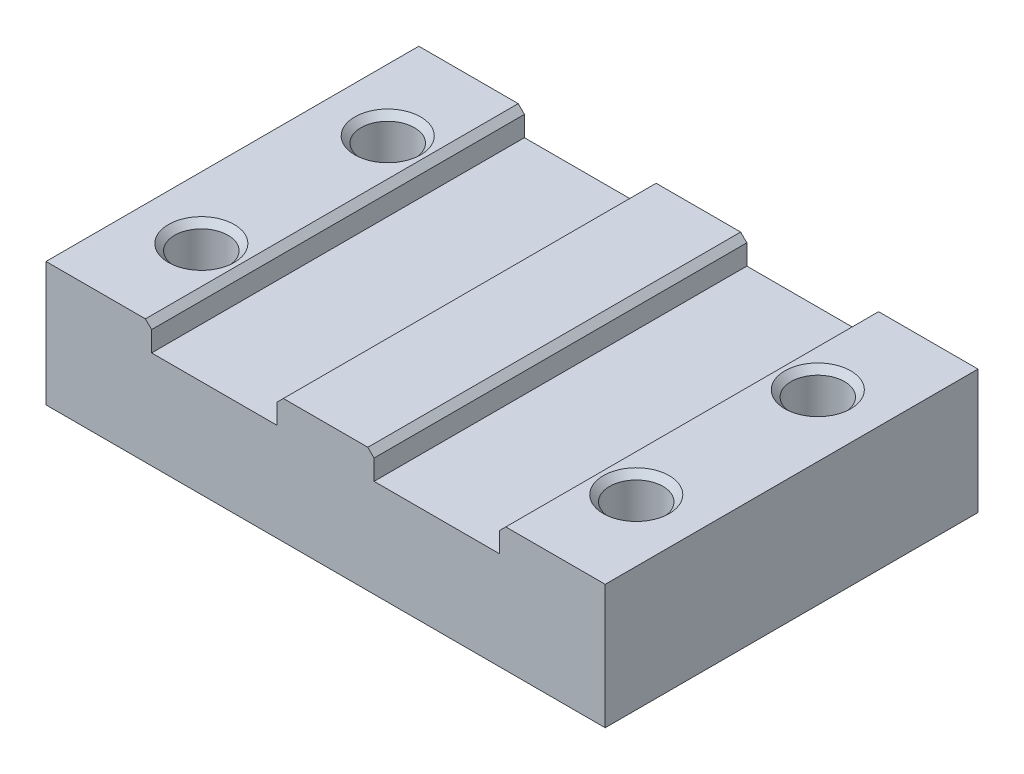
ISO-10303-21;
HEADER;
FILE_DESCRIPTION(('STEP AP214'),'2;1');
FILE_NAME('part.step','',(''),(''),'','','');
FILE_SCHEMA(('AUTOMOTIVE_DESIGN { 1 0 10303 214 1 1 1 1 }'));
ENDSEC;
DATA;
#1=APPLICATION_CONTEXT('core data for automotive mechanical design processes');
#2=APPLICATION_PROTOCOL_DEFINITION('international standard','automotive_design',2000,#1);
#3=PRODUCT_CONTEXT('',#1,'mechanical');
#4=PRODUCT('Part','Part','',(#3));
#5=PRODUCT_RELATED_PRODUCT_CATEGORY('part','',(#4));
#6=PRODUCT_DEFINITION_FORMATION('','',#4);
#7=PRODUCT_DEFINITION_CONTEXT('part definition',#1,'design');
#8=PRODUCT_DEFINITION('design','',#6,#7);
#9=PRODUCT_DEFINITION_SHAPE('','',#8);
#10=(LENGTH_UNIT() NAMED_UNIT(*) SI_UNIT(.MILLI.,.METRE.));
#11=(NAMED_UNIT(*) PLANE_ANGLE_UNIT() SI_UNIT($,.RADIAN.));
#12=(NAMED_UNIT(*) SI_UNIT($,.STERADIAN.) SOLID_ANGLE_UNIT());
#13=UNCERTAINTY_MEASURE_WITH_UNIT(LENGTH_MEASURE(1.E-05),#10,'distance_accuracy_value','');
#14=(GEOMETRIC_REPRESENTATION_CONTEXT(3) GLOBAL_UNCERTAINTY_ASSIGNED_CONTEXT((#13)) GLOBAL_UNIT_ASSIGNED_CONTEXT((#10,
#11,#12)) REPRESENTATION_CONTEXT('',''));
#15=CARTESIAN_POINT('',(0.,0.,0.));
#16=DIRECTION('',(0.,0.,1.));
#17=DIRECTION('',(1.,0.,0.));
#18=AXIS2_PLACEMENT_3D('',#15,#16,#17);
#19=CARTESIAN_POINT('',(0.,20.,0.));
#20=DIRECTION('',(0.,1.,0.));
#21=DIRECTION('',(0.,0.,1.));
#22=AXIS2_PLACEMENT_3D('',#19,#20,#21);
#23=PLANE('',#22);
#24=CARTESIAN_POINT('',(35.,20.,-14.2172732356869));
#25=DIRECTION('',(0.,1.,0.));
#26=DIRECTION('',(0.,0.,1.));
#27=AXIS2_PLACEMENT_3D('',#24,#25,#26);
#28=CIRCLE('',#27,5.3);
#29=CARTESIAN_POINT('',(35.,20.,-8.91727323568689));
#30=VERTEX_POINT('',#29);
#31=EDGE_CURVE('E277',#30,#30,#28,.F.);
#32=ORIENTED_EDGE('',*,*,#31,.T.);
#33=EDGE_LOOP('',(#32));
#34=FACE_BOUND('',#33,.T.);
#35=CARTESIAN_POINT('',(35.,20.,15.));
#36=DIRECTION('',(0.,1.,0.));
#37=DIRECTION('',(0.,0.,1.));
#38=AXIS2_PLACEMENT_3D('',#35,#36,#37);
#39=CIRCLE('',#38,5.3);
#40=CARTESIAN_POINT('',(35.,20.,20.3));
#41=VERTEX_POINT('',#40);
#42=EDGE_CURVE('E274',#41,#41,#39,.F.);
#43=ORIENTED_EDGE('',*,*,#42,.T.);
#44=EDGE_LOOP('',(#43));
#45=FACE_BOUND('',#44,.T.);
#46=DIRECTION('',(-1.,0.,0.));
#47=VECTOR('',#46,1.);
#48=CARTESIAN_POINT('',(45.,20.,-30.));
#49=LINE('',#48,#47);
#50=CARTESIAN_POINT('',(45.,20.,-30.));
#51=VERTEX_POINT('',#50);
#52=CARTESIAN_POINT('',(29.,20.,-30.));
#53=VERTEX_POINT('',#52);
#54=EDGE_CURVE('E218',#51,#53,#49,.T.);
#55=ORIENTED_EDGE('',*,*,#54,.T.);
#56=DIRECTION('',(0.,0.,1.));
#57=VECTOR('',#56,1.);
#58=CARTESIAN_POINT('',(29.,20.,30.));
#59=LINE('',#58,#57);
#60=CARTESIAN_POINT('',(29.,20.,30.));
#61=VERTEX_POINT('',#60);
#62=EDGE_CURVE('E272',#53,#61,#59,.T.);
#63=ORIENTED_EDGE('',*,*,#62,.T.);
#64=DIRECTION('',(1.,0.,0.));
#65=VECTOR('',#64,1.);
#66=CARTESIAN_POINT('',(45.,20.,30.));
#67=LINE('',#66,#65);
#68=CARTESIAN_POINT('',(45.,20.,30.));
#69=VERTEX_POINT('',#68);
#70=EDGE_CURVE('E209',#61,#69,#67,.T.);
#71=ORIENTED_EDGE('',*,*,#70,.T.);
#72=DIRECTION('',(0.,0.,-1.));
#73=VECTOR('',#72,1.);
#74=CARTESIAN_POINT('',(45.,20.,30.));
#75=LINE('',#74,#73);
#76=EDGE_CURVE('E214',#69,#51,#75,.T.);
#77=ORIENTED_EDGE('',*,*,#76,.T.);
#78=EDGE_LOOP('',(#55,#63,#71,#77));
#79=FACE_BOUND('',#78,.T.);
#80=ADVANCED_FACE('F35',(#34,#45,#79),#23,.T.);
#81=CARTESIAN_POINT('',(-35.,20.,15.));
#82=DIRECTION('',(0.,1.,0.));
#83=DIRECTION('',(0.,0.,1.));
#84=AXIS2_PLACEMENT_3D('',#81,#82,#83);
#85=CIRCLE('',#84,5.3);
#86=CARTESIAN_POINT('',(-35.,20.,20.3));
#87=VERTEX_POINT('',#86);
#88=EDGE_CURVE('E289',#87,#87,#85,.F.);
#89=ORIENTED_EDGE('',*,*,#88,.T.);
#90=EDGE_LOOP('',(#89));
#91=FACE_BOUND('',#90,.T.);
#92=CARTESIAN_POINT('',(-35.,20.,-15.));
#93=DIRECTION('',(0.,1.,0.));
#94=DIRECTION('',(0.,0.,1.));
#95=AXIS2_PLACEMENT_3D('',#92,#93,#94);
#96=CIRCLE('',#95,5.3);
#97=CARTESIAN_POINT('',(-35.,20.,-9.7));
#98=VERTEX_POINT('',#97);
#99=EDGE_CURVE('E286',#98,#98,#96,.F.);
#100=ORIENTED_EDGE('',*,*,#99,.T.);
#101=EDGE_LOOP('',(#100));
#102=FACE_BOUND('',#101,.T.);
#103=CARTESIAN_POINT('',(-45.,20.,30.));
#104=VERTEX_POINT('',#103);
#105=CARTESIAN_POINT('',(-29.,20.,30.));
#106=VERTEX_POINT('',#105);
#107=EDGE_CURVE('E211',#104,#106,#67,.T.);
#108=ORIENTED_EDGE('',*,*,#107,.T.);
#109=DIRECTION('',(0.,0.,-1.));
#110=VECTOR('',#109,1.);
#111=CARTESIAN_POINT('',(-29.,20.,-30.));
#112=LINE('',#111,#110);
#113=CARTESIAN_POINT('',(-29.,20.,-30.));
#114=VERTEX_POINT('',#113);
#115=EDGE_CURVE('E267',#106,#114,#112,.T.);
#116=ORIENTED_EDGE('',*,*,#115,.T.);
#117=CARTESIAN_POINT('',(-45.,20.,-30.));
#118=VERTEX_POINT('',#117);
#119=EDGE_CURVE('E217',#114,#118,#49,.T.);
#120=ORIENTED_EDGE('',*,*,#119,.T.);
#121=DIRECTION('',(0.,0.,1.));
#122=VECTOR('',#121,1.);
#123=CARTESIAN_POINT('',(-45.,20.,30.));
#124=LINE('',#123,#122);
#125=EDGE_CURVE('E206',#118,#104,#124,.T.);
#126=ORIENTED_EDGE('',*,*,#125,.T.);
#127=EDGE_LOOP('',(#108,#116,#120,#126));
#128=FACE_BOUND('',#127,.T.);
#129=ADVANCED_FACE('F303',(#91,#102,#128),#23,.T.);
#130=CARTESIAN_POINT('',(-45.,20.,30.));
#131=DIRECTION('',(1.,0.,0.));
#132=DIRECTION('',(0.,0.,-1.));
#133=AXIS2_PLACEMENT_3D('',#130,#131,#132);
#134=PLANE('',#133);
#135=DIRECTION('',(0.,0.,1.));
#136=VECTOR('',#135,1.);
#137=CARTESIAN_POINT('',(-45.,0.,30.));
#138=LINE('',#137,#136);
#139=CARTESIAN_POINT('',(-45.,0.,-30.));
#140=VERTEX_POINT('',#139);
#141=CARTESIAN_POINT('',(-45.,0.,30.));
#142=VERTEX_POINT('',#141);
#143=EDGE_CURVE('E201',#140,#142,#138,.T.);
#144=ORIENTED_EDGE('',*,*,#143,.T.);
#145=DIRECTION('',(0.,-1.,0.));
#146=VECTOR('',#145,1.);
#147=CARTESIAN_POINT('',(-45.,20.,30.));
#148=LINE('',#147,#146);
#149=EDGE_CURVE('E238',#104,#142,#148,.T.);
#150=ORIENTED_EDGE('',*,*,#149,.F.);
#151=ORIENTED_EDGE('',*,*,#125,.F.);
#152=DIRECTION('',(0.,-1.,0.));
#153=VECTOR('',#152,1.);
#154=CARTESIAN_POINT('',(-45.,20.,-30.));
#155=LINE('',#154,#153);
#156=EDGE_CURVE('E221',#118,#140,#155,.T.);
#157=ORIENTED_EDGE('',*,*,#156,.T.);
#158=EDGE_LOOP('',(#144,#150,#151,#157));
#159=FACE_BOUND('',#158,.T.);
#160=ADVANCED_FACE('F306',(#159),#134,.F.);
#161=CARTESIAN_POINT('',(45.,20.,30.));
#162=DIRECTION('',(0.,0.,-1.));
#163=DIRECTION('',(-1.,0.,0.));
#164=AXIS2_PLACEMENT_3D('',#161,#162,#163);
#165=PLANE('',#164);
#166=CARTESIAN_POINT('',(-6.79999999999997,20.,30.));
#167=VERTEX_POINT('',#166);
#168=CARTESIAN_POINT('',(6.80000000000004,20.,30.));
#169=VERTEX_POINT('',#168);
#170=EDGE_CURVE('E215',#167,#169,#67,.T.);
#171=ORIENTED_EDGE('',*,*,#170,.F.);
#172=DIRECTION('',(-0.707106781186548,-0.707106781186548,0.));
#173=VECTOR('',#172,1.);
#174=CARTESIAN_POINT('',(-6.79999999999998,20.,30.));
#175=LINE('',#174,#173);
#176=CARTESIAN_POINT('',(-7.79999999999999,19.,30.));
#177=VERTEX_POINT('',#176);
#178=EDGE_CURVE('E252',#167,#177,#175,.T.);
#179=ORIENTED_EDGE('',*,*,#178,.T.);
#180=DIRECTION('',(0.,1.,0.));
#181=VECTOR('',#180,1.);
#182=CARTESIAN_POINT('',(-7.8,20.,30.));
#183=LINE('',#182,#181);
#184=CARTESIAN_POINT('',(-7.79999999999999,15.75,30.));
#185=VERTEX_POINT('',#184);
#186=EDGE_CURVE('E190',#185,#177,#183,.T.);
#187=ORIENTED_EDGE('',*,*,#186,.F.);
#188=DIRECTION('',(1.,0.,0.));
#189=VECTOR('',#188,1.);
#190=CARTESIAN_POINT('',(-7.79999999999999,15.75,30.));
#191=LINE('',#190,#189);
#192=CARTESIAN_POINT('',(-28.,15.75,30.));
#193=VERTEX_POINT('',#192);
#194=EDGE_CURVE('E156',#193,#185,#191,.T.);
#195=ORIENTED_EDGE('',*,*,#194,.F.);
#196=DIRECTION('',(0.,-1.,0.));
#197=VECTOR('',#196,1.);
#198=CARTESIAN_POINT('',(-28.,24.25,30.));
#199=LINE('',#198,#197);
#200=CARTESIAN_POINT('',(-28.,19.,30.));
#201=VERTEX_POINT('',#200);
#202=EDGE_CURVE('E173',#201,#193,#199,.T.);
#203=ORIENTED_EDGE('',*,*,#202,.F.);
#204=DIRECTION('',(-0.707106781186543,0.707106781186552,0.));
#205=VECTOR('',#204,1.);
#206=CARTESIAN_POINT('',(-28.,19.,30.));
#207=LINE('',#206,#205);
#208=EDGE_CURVE('E248',#201,#106,#207,.T.);
#209=ORIENTED_EDGE('',*,*,#208,.T.);
#210=ORIENTED_EDGE('',*,*,#107,.F.);
#211=ORIENTED_EDGE('',*,*,#149,.T.);
#212=DIRECTION('',(1.,0.,0.));
#213=VECTOR('',#212,1.);
#214=CARTESIAN_POINT('',(45.,0.,30.));
#215=LINE('',#214,#213);
#216=CARTESIAN_POINT('',(45.,0.,30.));
#217=VERTEX_POINT('',#216);
#218=EDGE_CURVE('E225',#142,#217,#215,.T.);
#219=ORIENTED_EDGE('',*,*,#218,.T.);
#220=DIRECTION('',(0.,-1.,0.));
#221=VECTOR('',#220,1.);
#222=CARTESIAN_POINT('',(45.,20.,30.));
#223=LINE('',#222,#221);
#224=EDGE_CURVE('E235',#69,#217,#223,.T.);
#225=ORIENTED_EDGE('',*,*,#224,.F.);
#226=ORIENTED_EDGE('',*,*,#70,.F.);
#227=DIRECTION('',(-0.707106781186544,-0.707106781186551,0.));
#228=VECTOR('',#227,1.);
#229=CARTESIAN_POINT('',(28.,19.,30.));
#230=LINE('',#229,#228);
#231=CARTESIAN_POINT('',(28.,19.,30.));
#232=VERTEX_POINT('',#231);
#233=EDGE_CURVE('E246',#61,#232,#230,.T.);
#234=ORIENTED_EDGE('',*,*,#233,.T.);
#235=DIRECTION('',(0.,1.,0.));
#236=VECTOR('',#235,1.);
#237=CARTESIAN_POINT('',(28.,24.25,30.));
#238=LINE('',#237,#236);
#239=CARTESIAN_POINT('',(28.,15.75,30.));
#240=VERTEX_POINT('',#239);
#241=EDGE_CURVE('E175',#240,#232,#238,.T.);
#242=ORIENTED_EDGE('',*,*,#241,.F.);
#243=DIRECTION('',(1.,0.,0.));
#244=VECTOR('',#243,1.);
#245=CARTESIAN_POINT('',(28.,15.75,30.));
#246=LINE('',#245,#244);
#247=CARTESIAN_POINT('',(7.80000000000001,15.75,30.));
#248=VERTEX_POINT('',#247);
#249=EDGE_CURVE('E194',#248,#240,#246,.T.);
#250=ORIENTED_EDGE('',*,*,#249,.F.);
#251=DIRECTION('',(0.,-1.,0.));
#252=VECTOR('',#251,1.);
#253=CARTESIAN_POINT('',(7.80000000000001,15.75,30.));
#254=LINE('',#253,#252);
#255=CARTESIAN_POINT('',(7.80000000000001,19.,30.));
#256=VERTEX_POINT('',#255);
#257=EDGE_CURVE('E192',#256,#248,#254,.T.);
#258=ORIENTED_EDGE('',*,*,#257,.F.);
#259=DIRECTION('',(-0.707106781186543,0.707106781186552,0.));
#260=VECTOR('',#259,1.);
#261=CARTESIAN_POINT('',(7.80000000000001,19.,30.));
#262=LINE('',#261,#260);
#263=EDGE_CURVE('E250',#256,#169,#262,.T.);
#264=ORIENTED_EDGE('',*,*,#263,.T.);
#265=EDGE_LOOP('',(#171,#179,#187,#195,#203,#209,#210,#211,#219,#225,#226,#234,#242,#250,#258,#264));
#266=FACE_BOUND('',#265,.T.);
#267=ADVANCED_FACE('F322',(#266),#165,.F.);
#268=CARTESIAN_POINT('',(45.,20.,30.));
#269=DIRECTION('',(-1.,0.,0.));
#270=DIRECTION('',(0.,0.,1.));
#271=AXIS2_PLACEMENT_3D('',#268,#269,#270);
#272=PLANE('',#271);
#273=DIRECTION('',(0.,0.,-1.));
#274=VECTOR('',#273,1.);
#275=CARTESIAN_POINT('',(45.,0.,30.));
#276=LINE('',#275,#274);
#277=CARTESIAN_POINT('',(45.,0.,-30.));
#278=VERTEX_POINT('',#277);
#279=EDGE_CURVE('E227',#217,#278,#276,.T.);
#280=ORIENTED_EDGE('',*,*,#279,.T.);
#281=DIRECTION('',(0.,-1.,0.));
#282=VECTOR('',#281,1.);
#283=CARTESIAN_POINT('',(45.,20.,-30.));
#284=LINE('',#283,#282);
#285=EDGE_CURVE('E232',#51,#278,#284,.T.);
#286=ORIENTED_EDGE('',*,*,#285,.F.);
#287=ORIENTED_EDGE('',*,*,#76,.F.);
#288=ORIENTED_EDGE('',*,*,#224,.T.);
#289=EDGE_LOOP('',(#280,#286,#287,#288));
#290=FACE_BOUND('',#289,.T.);
#291=ADVANCED_FACE('F340',(#290),#272,.F.);
#292=CARTESIAN_POINT('',(45.,20.,-30.));
#293=DIRECTION('',(0.,0.,1.));
#294=DIRECTION('',(1.,0.,0.));
#295=AXIS2_PLACEMENT_3D('',#292,#293,#294);
#296=PLANE('',#295);
#297=DIRECTION('',(0.,1.,0.));
#298=VECTOR('',#297,1.);
#299=CARTESIAN_POINT('',(-7.8,20.,-30.));
#300=LINE('',#299,#298);
#301=CARTESIAN_POINT('',(-7.79999999999999,15.75,-30.));
#302=VERTEX_POINT('',#301);
#303=CARTESIAN_POINT('',(-7.79999999999999,19.,-30.));
#304=VERTEX_POINT('',#303);
#305=EDGE_CURVE('E164',#302,#304,#300,.T.);
#306=ORIENTED_EDGE('',*,*,#305,.T.);
#307=DIRECTION('',(0.707106781186548,0.707106781186548,0.));
#308=VECTOR('',#307,1.);
#309=CARTESIAN_POINT('',(-6.79999999999998,20.,-30.));
#310=LINE('',#309,#308);
#311=CARTESIAN_POINT('',(-6.79999999999997,20.,-30.));
#312=VERTEX_POINT('',#311);
#313=EDGE_CURVE('E259',#304,#312,#310,.T.);
#314=ORIENTED_EDGE('',*,*,#313,.T.);
#315=CARTESIAN_POINT('',(6.80000000000004,20.,-30.));
#316=VERTEX_POINT('',#315);
#317=EDGE_CURVE('E222',#316,#312,#49,.T.);
#318=ORIENTED_EDGE('',*,*,#317,.F.);
#319=DIRECTION('',(0.707106781186543,-0.707106781186552,0.));
#320=VECTOR('',#319,1.);
#321=CARTESIAN_POINT('',(7.80000000000001,19.,-30.));
#322=LINE('',#321,#320);
#323=CARTESIAN_POINT('',(7.80000000000001,19.,-30.));
#324=VERTEX_POINT('',#323);
#325=EDGE_CURVE('E50',#316,#324,#322,.T.);
#326=ORIENTED_EDGE('',*,*,#325,.T.);
#327=DIRECTION('',(0.,-1.,0.));
#328=VECTOR('',#327,1.);
#329=CARTESIAN_POINT('',(7.80000000000001,15.75,-30.));
#330=LINE('',#329,#328);
#331=CARTESIAN_POINT('',(7.80000000000001,15.75,-30.));
#332=VERTEX_POINT('',#331);
#333=EDGE_CURVE('E169',#324,#332,#330,.T.);
#334=ORIENTED_EDGE('',*,*,#333,.T.);
#335=DIRECTION('',(1.,0.,0.));
#336=VECTOR('',#335,1.);
#337=CARTESIAN_POINT('',(28.,15.75,-30.));
#338=LINE('',#337,#336);
#339=CARTESIAN_POINT('',(28.,15.75,-30.));
#340=VERTEX_POINT('',#339);
#341=EDGE_CURVE('E182',#332,#340,#338,.T.);
#342=ORIENTED_EDGE('',*,*,#341,.T.);
#343=DIRECTION('',(0.,1.,0.));
#344=VECTOR('',#343,1.);
#345=CARTESIAN_POINT('',(28.,24.25,-30.));
#346=LINE('',#345,#344);
#347=CARTESIAN_POINT('',(28.,19.,-30.));
#348=VERTEX_POINT('',#347);
#349=EDGE_CURVE('E185',#340,#348,#346,.T.);
#350=ORIENTED_EDGE('',*,*,#349,.T.);
#351=DIRECTION('',(0.707106781186544,0.707106781186551,0.));
#352=VECTOR('',#351,1.);
#353=CARTESIAN_POINT('',(28.,19.,-30.));
#354=LINE('',#353,#352);
#355=EDGE_CURVE('E255',#348,#53,#354,.T.);
#356=ORIENTED_EDGE('',*,*,#355,.T.);
#357=ORIENTED_EDGE('',*,*,#54,.F.);
#358=ORIENTED_EDGE('',*,*,#285,.T.);
#359=DIRECTION('',(-1.,0.,0.));
#360=VECTOR('',#359,1.);
#361=CARTESIAN_POINT('',(45.,0.,-30.));
#362=LINE('',#361,#360);
#363=EDGE_CURVE('E210',#278,#140,#362,.T.);
#364=ORIENTED_EDGE('',*,*,#363,.T.);
#365=ORIENTED_EDGE('',*,*,#156,.F.);
#366=ORIENTED_EDGE('',*,*,#119,.F.);
#367=DIRECTION('',(0.707106781186543,-0.707106781186552,0.));
#368=VECTOR('',#367,1.);
#369=CARTESIAN_POINT('',(-28.,19.,-30.));
#370=LINE('',#369,#368);
#371=CARTESIAN_POINT('',(-28.,19.,-30.));
#372=VERTEX_POINT('',#371);
#373=EDGE_CURVE('E57',#114,#372,#370,.T.);
#374=ORIENTED_EDGE('',*,*,#373,.T.);
#375=DIRECTION('',(0.,-1.,0.));
#376=VECTOR('',#375,1.);
#377=CARTESIAN_POINT('',(-28.,24.25,-30.));
#378=LINE('',#377,#376);
#379=CARTESIAN_POINT('',(-28.,15.75,-30.));
#380=VERTEX_POINT('',#379);
#381=EDGE_CURVE('E161',#372,#380,#378,.T.);
#382=ORIENTED_EDGE('',*,*,#381,.T.);
#383=DIRECTION('',(1.,0.,0.));
#384=VECTOR('',#383,1.);
#385=CARTESIAN_POINT('',(-7.79999999999999,15.75,-30.));
#386=LINE('',#385,#384);
#387=EDGE_CURVE('E154',#380,#302,#386,.T.);
#388=ORIENTED_EDGE('',*,*,#387,.T.);
#389=EDGE_LOOP('',(#306,#314,#318,#326,#334,#342,#350,#356,#357,#358,#364,#365,#366,#374,#382,#388));
#390=FACE_BOUND('',#389,.T.);
#391=ADVANCED_FACE('F171',(#390),#296,.F.);
#392=ORIENTED_EDGE('',*,*,#317,.T.);
#393=DIRECTION('',(0.,0.,1.));
#394=VECTOR('',#393,1.);
#395=CARTESIAN_POINT('',(-6.79999999999998,20.,30.));
#396=LINE('',#395,#394);
#397=EDGE_CURVE('E243',#312,#167,#396,.T.);
#398=ORIENTED_EDGE('',*,*,#397,.T.);
#399=ORIENTED_EDGE('',*,*,#170,.T.);
#400=DIRECTION('',(0.,0.,-1.));
#401=VECTOR('',#400,1.);
#402=CARTESIAN_POINT('',(6.80000000000002,20.,-30.));
#403=LINE('',#402,#401);
#404=EDGE_CURVE('E241',#169,#316,#403,.T.);
#405=ORIENTED_EDGE('',*,*,#404,.T.);
#406=EDGE_LOOP('',(#392,#398,#399,#405));
#407=FACE_BOUND('',#406,.T.);
#408=ADVANCED_FACE('F308',(#407),#23,.T.);
#409=CARTESIAN_POINT('',(0.,0.,0.));
#410=DIRECTION('',(0.,1.,0.));
#411=DIRECTION('',(0.,0.,1.));
#412=AXIS2_PLACEMENT_3D('',#409,#410,#411);
#413=PLANE('',#412);
#414=CARTESIAN_POINT('',(-35.,0.,-15.));
#415=DIRECTION('',(0.,-1.,0.));
#416=DIRECTION('',(0.,0.,-1.));
#417=AXIS2_PLACEMENT_3D('',#414,#415,#416);
#418=CIRCLE('',#417,4.3);
#419=CARTESIAN_POINT('',(-35.,0.,-19.3));
#420=VERTEX_POINT('',#419);
#421=EDGE_CURVE('E397',#420,#420,#418,.T.);
#422=ORIENTED_EDGE('',*,*,#421,.F.);
#423=EDGE_LOOP('',(#422));
#424=FACE_BOUND('',#423,.T.);
#425=CARTESIAN_POINT('',(35.,0.,-14.2172732356869));
#426=DIRECTION('',(0.,-1.,0.));
#427=DIRECTION('',(0.,0.,-1.));
#428=AXIS2_PLACEMENT_3D('',#425,#426,#427);
#429=CIRCLE('',#428,4.3);
#430=CARTESIAN_POINT('',(35.,0.,-18.5172732356869));
#431=VERTEX_POINT('',#430);
#432=EDGE_CURVE('E398',#431,#431,#429,.T.);
#433=ORIENTED_EDGE('',*,*,#432,.F.);
#434=EDGE_LOOP('',(#433));
#435=FACE_BOUND('',#434,.T.);
#436=CARTESIAN_POINT('',(35.,0.,15.));
#437=DIRECTION('',(0.,-1.,0.));
#438=DIRECTION('',(0.,0.,-1.));
#439=AXIS2_PLACEMENT_3D('',#436,#437,#438);
#440=CIRCLE('',#439,4.3);
#441=CARTESIAN_POINT('',(35.,0.,10.7));
#442=VERTEX_POINT('',#441);
#443=EDGE_CURVE('E402',#442,#442,#440,.T.);
#444=ORIENTED_EDGE('',*,*,#443,.F.);
#445=EDGE_LOOP('',(#444));
#446=FACE_BOUND('',#445,.T.);
#447=CARTESIAN_POINT('',(-35.,0.,15.));
#448=DIRECTION('',(0.,-1.,0.));
#449=DIRECTION('',(0.,0.,-1.));
#450=AXIS2_PLACEMENT_3D('',#447,#448,#449);
#451=CIRCLE('',#450,4.3);
#452=CARTESIAN_POINT('',(-35.,0.,10.7));
#453=VERTEX_POINT('',#452);
#454=EDGE_CURVE('E178',#453,#453,#451,.T.);
#455=ORIENTED_EDGE('',*,*,#454,.F.);
#456=EDGE_LOOP('',(#455));
#457=FACE_BOUND('',#456,.T.);
#458=ORIENTED_EDGE('',*,*,#143,.F.);
#459=ORIENTED_EDGE('',*,*,#363,.F.);
#460=ORIENTED_EDGE('',*,*,#279,.F.);
#461=ORIENTED_EDGE('',*,*,#218,.F.);
#462=EDGE_LOOP('',(#458,#459,#460,#461));
#463=FACE_BOUND('',#462,.T.);
#464=ADVANCED_FACE('F342',(#424,#435,#446,#457,#463),#413,.F.);
#465=CARTESIAN_POINT('',(-7.8,20.,-30.));
#466=DIRECTION('',(1.,0.,0.));
#467=DIRECTION('',(0.,1.,0.));
#468=AXIS2_PLACEMENT_3D('',#465,#466,#467);
#469=PLANE('',#468);
#470=ORIENTED_EDGE('',*,*,#186,.T.);
#471=DIRECTION('',(0.,0.,-1.));
#472=VECTOR('',#471,1.);
#473=CARTESIAN_POINT('',(-7.79999999999999,19.,-30.));
#474=LINE('',#473,#472);
#475=EDGE_CURVE('E167',#177,#304,#474,.T.);
#476=ORIENTED_EDGE('',*,*,#475,.T.);
#477=ORIENTED_EDGE('',*,*,#305,.F.);
#478=DIRECTION('',(0.,0.,1.));
#479=VECTOR('',#478,1.);
#480=CARTESIAN_POINT('',(-7.79999999999999,15.75,-30.));
#481=LINE('',#480,#479);
#482=EDGE_CURVE('E149',#302,#185,#481,.T.);
#483=ORIENTED_EDGE('',*,*,#482,.T.);
#484=EDGE_LOOP('',(#470,#476,#477,#483));
#485=FACE_BOUND('',#484,.T.);
#486=ADVANCED_FACE('F165',(#485),#469,.F.);
#487=CARTESIAN_POINT('',(-28.,24.25,-30.));
#488=DIRECTION('',(-1.,0.,0.));
#489=DIRECTION('',(0.,-1.,0.));
#490=AXIS2_PLACEMENT_3D('',#487,#488,#489);
#491=PLANE('',#490);
#492=ORIENTED_EDGE('',*,*,#381,.F.);
#493=DIRECTION('',(0.,0.,1.));
#494=VECTOR('',#493,1.);
#495=CARTESIAN_POINT('',(-28.,19.,30.));
#496=LINE('',#495,#494);
#497=EDGE_CURVE('E264',#372,#201,#496,.T.);
#498=ORIENTED_EDGE('',*,*,#497,.T.);
#499=ORIENTED_EDGE('',*,*,#202,.T.);
#500=DIRECTION('',(0.,0.,1.));
#501=VECTOR('',#500,1.);
#502=CARTESIAN_POINT('',(-28.,15.75,-30.));
#503=LINE('',#502,#501);
#504=EDGE_CURVE('E199',#380,#193,#503,.T.);
#505=ORIENTED_EDGE('',*,*,#504,.F.);
#506=EDGE_LOOP('',(#492,#498,#499,#505));
#507=FACE_BOUND('',#506,.T.);
#508=ADVANCED_FACE('F320',(#507),#491,.F.);
#509=CARTESIAN_POINT('',(-7.79999999999999,15.75,-30.));
#510=DIRECTION('',(0.,-1.,0.));
#511=DIRECTION('',(1.,0.,0.));
#512=AXIS2_PLACEMENT_3D('',#509,#510,#511);
#513=PLANE('',#512);
#514=ORIENTED_EDGE('',*,*,#194,.T.);
#515=ORIENTED_EDGE('',*,*,#482,.F.);
#516=ORIENTED_EDGE('',*,*,#387,.F.);
#517=ORIENTED_EDGE('',*,*,#504,.T.);
#518=EDGE_LOOP('',(#514,#515,#516,#517));
#519=FACE_BOUND('',#518,.T.);
#520=ADVANCED_FACE('F151',(#519),#513,.F.);
#521=CARTESIAN_POINT('',(28.,24.25,-30.));
#522=DIRECTION('',(1.,0.,0.));
#523=DIRECTION('',(0.,1.,0.));
#524=AXIS2_PLACEMENT_3D('',#521,#522,#523);
#525=PLANE('',#524);
#526=ORIENTED_EDGE('',*,*,#241,.T.);
#527=DIRECTION('',(0.,0.,-1.));
#528=VECTOR('',#527,1.);
#529=CARTESIAN_POINT('',(28.,19.,-30.));
#530=LINE('',#529,#528);
#531=EDGE_CURVE('E269',#232,#348,#530,.T.);
#532=ORIENTED_EDGE('',*,*,#531,.T.);
#533=ORIENTED_EDGE('',*,*,#349,.F.);
#534=DIRECTION('',(0.,0.,1.));
#535=VECTOR('',#534,1.);
#536=CARTESIAN_POINT('',(28.,15.75,-30.));
#537=LINE('',#536,#535);
#538=EDGE_CURVE('E202',#340,#240,#537,.T.);
#539=ORIENTED_EDGE('',*,*,#538,.T.);
#540=EDGE_LOOP('',(#526,#532,#533,#539));
#541=FACE_BOUND('',#540,.T.);
#542=ADVANCED_FACE('F361',(#541),#525,.F.);
#543=CARTESIAN_POINT('',(28.,15.75,-30.));
#544=DIRECTION('',(0.,-1.,0.));
#545=DIRECTION('',(0.,0.,-1.));
#546=AXIS2_PLACEMENT_3D('',#543,#544,#545);
#547=PLANE('',#546);
#548=ORIENTED_EDGE('',*,*,#249,.T.);
#549=ORIENTED_EDGE('',*,*,#538,.F.);
#550=ORIENTED_EDGE('',*,*,#341,.F.);
#551=DIRECTION('',(0.,0.,1.));
#552=VECTOR('',#551,1.);
#553=CARTESIAN_POINT('',(7.80000000000001,15.75,-30.));
#554=LINE('',#553,#552);
#555=EDGE_CURVE('E160',#332,#248,#554,.T.);
#556=ORIENTED_EDGE('',*,*,#555,.T.);
#557=EDGE_LOOP('',(#548,#549,#550,#556));
#558=FACE_BOUND('',#557,.T.);
#559=ADVANCED_FACE('F366',(#558),#547,.F.);
#560=CARTESIAN_POINT('',(7.80000000000001,15.75,-30.));
#561=DIRECTION('',(-1.,0.,0.));
#562=DIRECTION('',(0.,-1.,0.));
#563=AXIS2_PLACEMENT_3D('',#560,#561,#562);
#564=PLANE('',#563);
#565=ORIENTED_EDGE('',*,*,#333,.F.);
#566=DIRECTION('',(0.,0.,1.));
#567=VECTOR('',#566,1.);
#568=CARTESIAN_POINT('',(7.80000000000001,19.,30.));
#569=LINE('',#568,#567);
#570=EDGE_CURVE('E261',#324,#256,#569,.T.);
#571=ORIENTED_EDGE('',*,*,#570,.T.);
#572=ORIENTED_EDGE('',*,*,#257,.T.);
#573=ORIENTED_EDGE('',*,*,#555,.F.);
#574=EDGE_LOOP('',(#565,#571,#572,#573));
#575=FACE_BOUND('',#574,.T.);
#576=ADVANCED_FACE('F363',(#575),#564,.F.);
#577=CARTESIAN_POINT('',(-35.,20.,15.));
#578=DIRECTION('',(0.,-1.,0.));
#579=DIRECTION('',(0.,0.,-1.));
#580=AXIS2_PLACEMENT_3D('',#577,#578,#579);
#581=CYLINDRICAL_SURFACE('',#580,4.3);
#582=CARTESIAN_POINT('',(-35.,19.,15.));
#583=DIRECTION('',(0.,1.,0.));
#584=DIRECTION('',(0.,0.,1.));
#585=AXIS2_PLACEMENT_3D('',#582,#583,#584);
#586=CIRCLE('',#585,4.3);
#587=CARTESIAN_POINT('',(-35.,19.,19.3));
#588=VERTEX_POINT('',#587);
#589=EDGE_CURVE('E43',#588,#588,#586,.T.);
#590=ORIENTED_EDGE('',*,*,#589,.T.);
#591=EDGE_LOOP('',(#590));
#592=FACE_BOUND('',#591,.T.);
#593=ORIENTED_EDGE('',*,*,#454,.T.);
#594=EDGE_LOOP('',(#593));
#595=FACE_BOUND('',#594,.T.);
#596=ADVANCED_FACE('F294',(#592,#595),#581,.F.);
#597=CARTESIAN_POINT('',(35.,20.,15.));
#598=DIRECTION('',(0.,-1.,0.));
#599=DIRECTION('',(0.,0.,-1.));
#600=AXIS2_PLACEMENT_3D('',#597,#598,#599);
#601=CYLINDRICAL_SURFACE('',#600,4.3);
#602=CARTESIAN_POINT('',(35.,19.,15.));
#603=DIRECTION('',(0.,1.,0.));
#604=DIRECTION('',(0.,0.,1.));
#605=AXIS2_PLACEMENT_3D('',#602,#603,#604);
#606=CIRCLE('',#605,4.3);
#607=CARTESIAN_POINT('',(35.,19.,19.3));
#608=VERTEX_POINT('',#607);
#609=EDGE_CURVE('E283',#608,#608,#606,.T.);
#610=ORIENTED_EDGE('',*,*,#609,.T.);
#611=EDGE_LOOP('',(#610));
#612=FACE_BOUND('',#611,.T.);
#613=ORIENTED_EDGE('',*,*,#443,.T.);
#614=EDGE_LOOP('',(#613));
#615=FACE_BOUND('',#614,.T.);
#616=ADVANCED_FACE('F378',(#612,#615),#601,.F.);
#617=CARTESIAN_POINT('',(35.,20.,-14.2172732356869));
#618=DIRECTION('',(0.,-1.,0.));
#619=DIRECTION('',(0.,0.,-1.));
#620=AXIS2_PLACEMENT_3D('',#617,#618,#619);
#621=CYLINDRICAL_SURFACE('',#620,4.3);
#622=CARTESIAN_POINT('',(35.,19.,-14.2172732356869));
#623=DIRECTION('',(0.,1.,0.));
#624=DIRECTION('',(0.,0.,1.));
#625=AXIS2_PLACEMENT_3D('',#622,#623,#624);
#626=CIRCLE('',#625,4.3);
#627=CARTESIAN_POINT('',(35.,19.,-9.91727323568689));
#628=VERTEX_POINT('',#627);
#629=EDGE_CURVE('E280',#628,#628,#626,.T.);
#630=ORIENTED_EDGE('',*,*,#629,.T.);
#631=EDGE_LOOP('',(#630));
#632=FACE_BOUND('',#631,.T.);
#633=ORIENTED_EDGE('',*,*,#432,.T.);
#634=EDGE_LOOP('',(#633));
#635=FACE_BOUND('',#634,.T.);
#636=ADVANCED_FACE('F381',(#632,#635),#621,.F.);
#637=CARTESIAN_POINT('',(-35.,20.,-15.));
#638=DIRECTION('',(0.,-1.,0.));
#639=DIRECTION('',(0.,0.,-1.));
#640=AXIS2_PLACEMENT_3D('',#637,#638,#639);
#641=CYLINDRICAL_SURFACE('',#640,4.3);
#642=CARTESIAN_POINT('',(-35.,19.,-15.));
#643=DIRECTION('',(0.,1.,0.));
#644=DIRECTION('',(0.,0.,1.));
#645=AXIS2_PLACEMENT_3D('',#642,#643,#644);
#646=CIRCLE('',#645,4.3);
#647=CARTESIAN_POINT('',(-35.,19.,-10.7));
#648=VERTEX_POINT('',#647);
#649=EDGE_CURVE('E11',#648,#648,#646,.T.);
#650=ORIENTED_EDGE('',*,*,#649,.T.);
#651=EDGE_LOOP('',(#650));
#652=FACE_BOUND('',#651,.T.);
#653=ORIENTED_EDGE('',*,*,#421,.T.);
#654=EDGE_LOOP('',(#653));
#655=FACE_BOUND('',#654,.T.);
#656=ADVANCED_FACE('F385',(#652,#655),#641,.F.);
#657=CARTESIAN_POINT('',(-6.79999999999998,20.,0.));
#658=DIRECTION('',(-0.707106781186547,0.707106781186547,0.));
#659=DIRECTION('',(0.,0.,-1.));
#660=AXIS2_PLACEMENT_3D('',#657,#658,#659);
#661=PLANE('',#660);
#662=ORIENTED_EDGE('',*,*,#313,.F.);
#663=ORIENTED_EDGE('',*,*,#475,.F.);
#664=ORIENTED_EDGE('',*,*,#178,.F.);
#665=ORIENTED_EDGE('',*,*,#397,.F.);
#666=EDGE_LOOP('',(#662,#663,#664,#665));
#667=FACE_BOUND('',#666,.T.);
#668=ADVANCED_FACE('F324',(#667),#661,.T.);
#669=CARTESIAN_POINT('',(7.80000000000001,19.,-30.));
#670=DIRECTION('',(0.707106781186552,0.707106781186543,0.));
#671=DIRECTION('',(0.,0.,-1.));
#672=AXIS2_PLACEMENT_3D('',#669,#670,#671);
#673=PLANE('',#672);
#674=ORIENTED_EDGE('',*,*,#325,.F.);
#675=ORIENTED_EDGE('',*,*,#404,.F.);
#676=ORIENTED_EDGE('',*,*,#263,.F.);
#677=ORIENTED_EDGE('',*,*,#570,.F.);
#678=EDGE_LOOP('',(#674,#675,#676,#677));
#679=FACE_BOUND('',#678,.T.);
#680=ADVANCED_FACE('F392',(#679),#673,.T.);
#681=CARTESIAN_POINT('',(-28.,19.,-30.));
#682=DIRECTION('',(0.707106781186552,0.707106781186543,0.));
#683=DIRECTION('',(0.,0.,-1.));
#684=AXIS2_PLACEMENT_3D('',#681,#682,#683);
#685=PLANE('',#684);
#686=ORIENTED_EDGE('',*,*,#373,.F.);
#687=ORIENTED_EDGE('',*,*,#115,.F.);
#688=ORIENTED_EDGE('',*,*,#208,.F.);
#689=ORIENTED_EDGE('',*,*,#497,.F.);
#690=EDGE_LOOP('',(#686,#687,#688,#689));
#691=FACE_BOUND('',#690,.T.);
#692=ADVANCED_FACE('F316',(#691),#685,.T.);
#693=CARTESIAN_POINT('',(28.,19.,-30.));
#694=DIRECTION('',(-0.707106781186551,0.707106781186544,0.));
#695=DIRECTION('',(0.,0.,1.));
#696=AXIS2_PLACEMENT_3D('',#693,#694,#695);
#697=PLANE('',#696);
#698=ORIENTED_EDGE('',*,*,#233,.F.);
#699=ORIENTED_EDGE('',*,*,#62,.F.);
#700=ORIENTED_EDGE('',*,*,#355,.F.);
#701=ORIENTED_EDGE('',*,*,#531,.F.);
#702=EDGE_LOOP('',(#698,#699,#700,#701));
#703=FACE_BOUND('',#702,.T.);
#704=ADVANCED_FACE('F435',(#703),#697,.T.);
#705=CARTESIAN_POINT('',(35.,20.,-14.2172732356869));
#706=DIRECTION('',(0.,1.,0.));
#707=DIRECTION('',(0.,0.,1.));
#708=AXIS2_PLACEMENT_3D('',#705,#706,#707);
#709=CONICAL_SURFACE('',#708,5.3,0.78539816339745);
#710=ORIENTED_EDGE('',*,*,#629,.F.);
#711=EDGE_LOOP('',(#710));
#712=FACE_BOUND('',#711,.T.);
#713=ORIENTED_EDGE('',*,*,#31,.F.);
#714=EDGE_LOOP('',(#713));
#715=FACE_BOUND('',#714,.T.);
#716=ADVANCED_FACE('F427',(#712,#715),#709,.F.);
#717=CARTESIAN_POINT('',(35.,20.,15.));
#718=DIRECTION('',(0.,1.,0.));
#719=DIRECTION('',(0.,0.,1.));
#720=AXIS2_PLACEMENT_3D('',#717,#718,#719);
#721=CONICAL_SURFACE('',#720,5.3,0.78539816339745);
#722=ORIENTED_EDGE('',*,*,#609,.F.);
#723=EDGE_LOOP('',(#722));
#724=FACE_BOUND('',#723,.T.);
#725=ORIENTED_EDGE('',*,*,#42,.F.);
#726=EDGE_LOOP('',(#725));
#727=FACE_BOUND('',#726,.T.);
#728=ADVANCED_FACE('F300',(#724,#727),#721,.F.);
#729=CARTESIAN_POINT('',(-35.,20.,15.));
#730=DIRECTION('',(0.,1.,0.));
#731=DIRECTION('',(0.,0.,1.));
#732=AXIS2_PLACEMENT_3D('',#729,#730,#731);
#733=CONICAL_SURFACE('',#732,5.3,0.785398163397449);
#734=ORIENTED_EDGE('',*,*,#589,.F.);
#735=EDGE_LOOP('',(#734));
#736=FACE_BOUND('',#735,.T.);
#737=ORIENTED_EDGE('',*,*,#88,.F.);
#738=EDGE_LOOP('',(#737));
#739=FACE_BOUND('',#738,.T.);
#740=ADVANCED_FACE('F297',(#736,#739),#733,.F.);
#741=CARTESIAN_POINT('',(-35.,20.,-15.));
#742=DIRECTION('',(0.,1.,0.));
#743=DIRECTION('',(0.,0.,1.));
#744=AXIS2_PLACEMENT_3D('',#741,#742,#743);
#745=CONICAL_SURFACE('',#744,5.3,0.785398163397449);
#746=ORIENTED_EDGE('',*,*,#649,.F.);
#747=EDGE_LOOP('',(#746));
#748=FACE_BOUND('',#747,.T.);
#749=ORIENTED_EDGE('',*,*,#99,.F.);
#750=EDGE_LOOP('',(#749));
#751=FACE_BOUND('',#750,.T.);
#752=ADVANCED_FACE('F37',(#748,#751),#745,.F.);
#753=CLOSED_SHELL('',(#80,#129,#160,#267,#291,#391,#408,#464,#486,#508,#520,#542,#559,#576,#596,
#616,#636,#656,#668,#680,#692,#704,#716,#728,#740,#752));
#754=MANIFOLD_SOLID_BREP('B2',#753);
#755=ADVANCED_BREP_SHAPE_REPRESENTATION('',(#18,#754),#14);
#756=SHAPE_DEFINITION_REPRESENTATION(#9,#755);
ENDSEC;
END-ISO-10303-21;
